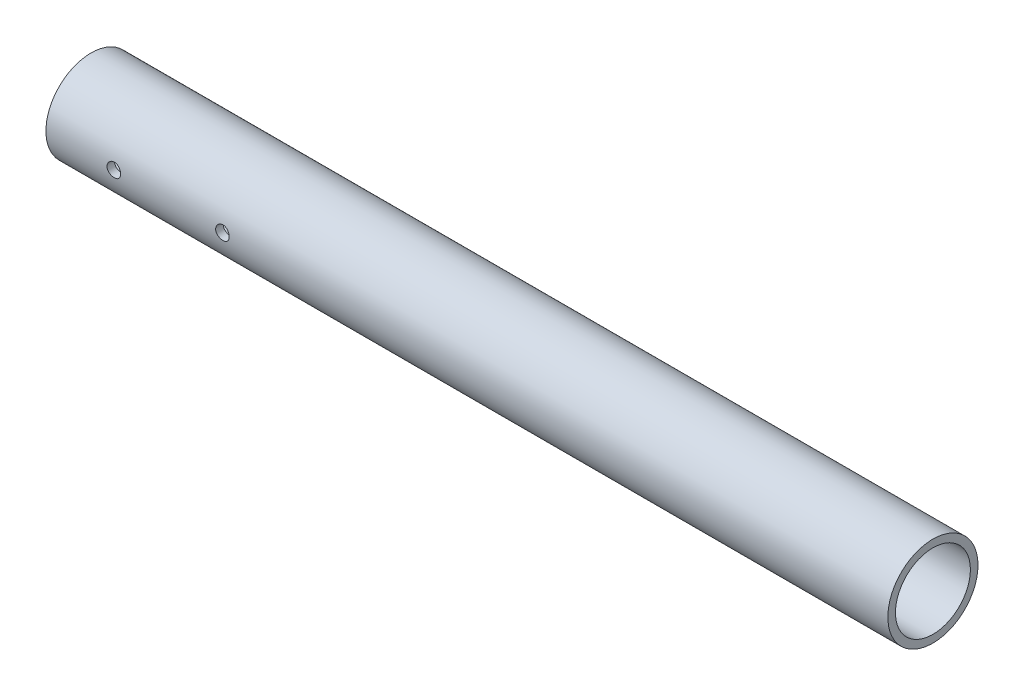
ISO-10303-21;
HEADER;
FILE_DESCRIPTION(('STEP AP214'),'2;1');
FILE_NAME('part.step','',(''),(''),'','','');
FILE_SCHEMA(('AUTOMOTIVE_DESIGN { 1 0 10303 214 1 1 1 1 }'));
ENDSEC;
DATA;
#1=APPLICATION_CONTEXT('core data for automotive mechanical design processes');
#2=APPLICATION_PROTOCOL_DEFINITION('international standard','automotive_design',2000,#1);
#3=PRODUCT_CONTEXT('',#1,'mechanical');
#4=PRODUCT('Part','Part','',(#3));
#5=PRODUCT_RELATED_PRODUCT_CATEGORY('part','',(#4));
#6=PRODUCT_DEFINITION_FORMATION('','',#4);
#7=PRODUCT_DEFINITION_CONTEXT('part definition',#1,'design');
#8=PRODUCT_DEFINITION('design','',#6,#7);
#9=PRODUCT_DEFINITION_SHAPE('','',#8);
#10=(LENGTH_UNIT() NAMED_UNIT(*) SI_UNIT(.MILLI.,.METRE.));
#11=(NAMED_UNIT(*) PLANE_ANGLE_UNIT() SI_UNIT($,.RADIAN.));
#12=(NAMED_UNIT(*) SI_UNIT($,.STERADIAN.) SOLID_ANGLE_UNIT());
#13=UNCERTAINTY_MEASURE_WITH_UNIT(LENGTH_MEASURE(1.E-05),#10,'distance_accuracy_value','');
#14=(GEOMETRIC_REPRESENTATION_CONTEXT(3) GLOBAL_UNCERTAINTY_ASSIGNED_CONTEXT((#13)) GLOBAL_UNIT_ASSIGNED_CONTEXT((#10,
#11,#12)) REPRESENTATION_CONTEXT('',''));
#15=CARTESIAN_POINT('',(0.,0.,0.));
#16=DIRECTION('',(0.,0.,1.));
#17=DIRECTION('',(1.,0.,0.));
#18=AXIS2_PLACEMENT_3D('',#15,#16,#17);
#19=CARTESIAN_POINT('',(-196.85,0.,0.));
#20=DIRECTION('',(1.,0.,0.));
#21=DIRECTION('',(0.,0.,-1.));
#22=AXIS2_PLACEMENT_3D('',#19,#20,#21);
#23=CYLINDRICAL_SURFACE('',#22,21.082);
#24=CARTESIAN_POINT('',(-196.85,0.,0.));
#25=DIRECTION('',(1.,0.,0.));
#26=DIRECTION('',(0.,0.,-1.));
#27=AXIS2_PLACEMENT_3D('',#24,#25,#26);
#28=CIRCLE('',#27,21.082);
#29=CARTESIAN_POINT('',(-196.85,0.,-21.082));
#30=VERTEX_POINT('',#29);
#31=EDGE_CURVE('E10',#30,#30,#28,.T.);
#32=ORIENTED_EDGE('',*,*,#31,.T.);
#33=EDGE_LOOP('',(#32));
#34=FACE_BOUND('',#33,.T.);
#35=CARTESIAN_POINT('',(196.85,0.,0.));
#36=DIRECTION('',(1.,0.,0.));
#37=DIRECTION('',(0.,0.,-1.));
#38=AXIS2_PLACEMENT_3D('',#35,#36,#37);
#39=CIRCLE('',#38,21.082);
#40=CARTESIAN_POINT('',(196.85,0.,-21.082));
#41=VERTEX_POINT('',#40);
#42=EDGE_CURVE('E53',#41,#41,#39,.T.);
#43=ORIENTED_EDGE('',*,*,#42,.F.);
#44=EDGE_LOOP('',(#43));
#45=FACE_BOUND('',#44,.T.);
#46=CARTESIAN_POINT('',(-168.275,0.,21.082));
#47=CARTESIAN_POINT('',(-168.274992696243,0.177265588906064,21.0819971511082));
#48=CARTESIAN_POINT('',(-168.260104327722,0.354633825443566,21.0797407978607));
#49=CARTESIAN_POINT('',(-168.200959639785,0.704412011201187,21.0709569196678));
#50=CARTESIAN_POINT('',(-168.156674780004,0.876816971803984,21.064425243998));
#51=CARTESIAN_POINT('',(-168.040090861165,1.2115560497482,21.0478246855302));
#52=CARTESIAN_POINT('',(-167.967813035828,1.37389769247854,21.0377584843423));
#53=CARTESIAN_POINT('',(-167.797346902468,1.68412370373541,21.0152009969064));
#54=CARTESIAN_POINT('',(-167.69916217104,1.8320100640365,21.0027100454717));
#55=CARTESIAN_POINT('',(-167.478845794194,2.11031643435081,20.9765819826565));
#56=CARTESIAN_POINT('',(-167.3565504399,2.24060616148059,20.9629374218632));
#57=CARTESIAN_POINT('',(-167.091836613573,2.47889671955909,20.9360982303561));
#58=CARTESIAN_POINT('',(-166.949416981135,2.58689626432784,20.9229036256421));
#59=CARTESIAN_POINT('',(-166.647621345587,2.77804840978029,20.8983859912104));
#60=CARTESIAN_POINT('',(-166.488164593206,2.86107486347093,20.8870725883659));
#61=CARTESIAN_POINT('',(-166.157370426842,2.99911783525678,20.8677000439257));
#62=CARTESIAN_POINT('',(-165.986033666236,3.05413589237425,20.8596407235276));
#63=CARTESIAN_POINT('',(-165.637713637157,3.13419550245969,20.8477621012251));
#64=CARTESIAN_POINT('',(-165.460782744137,3.15946016290709,20.8439112577396));
#65=CARTESIAN_POINT('',(-165.105154056933,3.17998699422211,20.8407898425614));
#66=CARTESIAN_POINT('',(-164.926456365603,3.17525090142445,20.8415190057945));
#67=CARTESIAN_POINT('',(-164.573943290049,3.13609297404926,20.8474463775802));
#68=CARTESIAN_POINT('',(-164.40009957517,3.101919701057,20.852607165254));
#69=CARTESIAN_POINT('',(-164.060642024393,3.00524659900985,20.8667578327125));
#70=CARTESIAN_POINT('',(-163.895028423173,2.9427459627244,20.8757478216156));
#71=CARTESIAN_POINT('',(-163.57597641876,2.79093400118089,20.8965852461813));
#72=CARTESIAN_POINT('',(-163.422588837981,2.70151746318002,20.9084438587404));
#73=CARTESIAN_POINT('',(-163.132900855916,2.49848682809598,20.9336742925736));
#74=CARTESIAN_POINT('',(-162.996601585936,2.38487113028626,20.9470462139227));
#75=CARTESIAN_POINT('',(-162.743518756676,2.13530326568608,20.9739618878807));
#76=CARTESIAN_POINT('',(-162.626945855511,1.99913740955179,20.9875060134767));
#77=CARTESIAN_POINT('',(-162.418274544488,1.70906259522473,21.0131148002247));
#78=CARTESIAN_POINT('',(-162.326176243369,1.55515355820367,21.0251794548033));
#79=CARTESIAN_POINT('',(-162.169057340399,1.23377816277263,21.0464826923882));
#80=CARTESIAN_POINT('',(-162.104053073529,1.0663036982249,21.0557195696406));
#81=CARTESIAN_POINT('',(-162.003151041654,0.722645240857121,21.070312259879));
#82=CARTESIAN_POINT('',(-161.967251292923,0.546461842495148,21.0756683373726));
#83=CARTESIAN_POINT('',(-161.925857666781,0.192204765370476,21.0818608911754));
#84=CARTESIAN_POINT('',(-161.920074191204,0.014165649847102,21.0827404122035));
#85=CARTESIAN_POINT('',(-161.938308481612,-0.340339952440584,21.0799979514801));
#86=CARTESIAN_POINT('',(-161.962325317379,-0.516806488119846,21.0763761102388));
#87=CARTESIAN_POINT('',(-162.039237666121,-0.862279899383923,21.0650645063623));
#88=CARTESIAN_POINT('',(-162.091992010307,-1.03131891039135,21.0573946347692));
#89=CARTESIAN_POINT('',(-162.224732948251,-1.35815274399451,21.0388441665934));
#90=CARTESIAN_POINT('',(-162.304720829788,-1.51594703443955,21.0279634181826));
#91=CARTESIAN_POINT('',(-162.490337139215,-1.81708511576191,21.0040933283749));
#92=CARTESIAN_POINT('',(-162.596149173084,-1.9603145348408,20.9910891189132));
#93=CARTESIAN_POINT('',(-162.830154648818,-2.22708618632573,20.9644655933992));
#94=CARTESIAN_POINT('',(-162.958349402479,-2.35062726403488,20.9508462413297));
#95=CARTESIAN_POINT('',(-163.234770906888,-2.57556977848286,20.9243908347895));
#96=CARTESIAN_POINT('',(-163.383156506261,-2.67677703259561,20.9115622997957));
#97=CARTESIAN_POINT('',(-163.694991994603,-2.8528290309045,20.888274456038));
#98=CARTESIAN_POINT('',(-163.858441473836,-2.92767449187153,20.8778150828597));
#99=CARTESIAN_POINT('',(-164.195187201683,-3.04857772519442,20.8605043047131));
#100=CARTESIAN_POINT('',(-164.368446144862,-3.09473749350594,20.8536401303661));
#101=CARTESIAN_POINT('',(-164.720368391081,-3.15728352894343,20.8442630448294));
#102=CARTESIAN_POINT('',(-164.899031316753,-3.17367187018762,20.8417498305174));
#103=CARTESIAN_POINT('',(-165.25475433616,-3.17616021106899,20.8413705974415));
#104=CARTESIAN_POINT('',(-165.431812319645,-3.16256554437416,20.8434577306442));
#105=CARTESIAN_POINT('',(-165.781093207795,-3.10612829026899,20.8519421795031));
#106=CARTESIAN_POINT('',(-165.95331612046,-3.0632857512491,20.8583394880282));
#107=CARTESIAN_POINT('',(-166.287952316415,-2.94967717748468,20.874707044174));
#108=CARTESIAN_POINT('',(-166.450373046203,-2.87893265513936,20.8846745386426));
#109=CARTESIAN_POINT('',(-166.761089428502,-2.71155871536681,20.9070627102117));
#110=CARTESIAN_POINT('',(-166.909384594736,-2.61492840724793,20.9194834717215));
#111=CARTESIAN_POINT('',(-167.189191280687,-2.39741725845486,20.9455292166376));
#112=CARTESIAN_POINT('',(-167.320526091709,-2.27631033164998,20.9591647100844));
#113=CARTESIAN_POINT('',(-167.561117181648,-2.01376149306829,20.9860159394496));
#114=CARTESIAN_POINT('',(-167.670368323069,-1.87231486257536,20.9992315770924));
#115=CARTESIAN_POINT('',(-167.864233030242,-1.57217776718591,21.0238378848768));
#116=CARTESIAN_POINT('',(-167.948706474533,-1.41339594518085,21.0352180180234));
#117=CARTESIAN_POINT('',(-168.089658721969,-1.08380087043068,21.0547677779054));
#118=CARTESIAN_POINT('',(-168.146166480664,-0.913000272113377,21.0629407235248));
#119=CARTESIAN_POINT('',(-168.216783136409,-0.617864332480806,21.0732924950954));
#120=CARTESIAN_POINT('',(-168.238581040015,-0.495349503289414,21.0765410154751));
#121=CARTESIAN_POINT('',(-168.267691941695,-0.248573261637352,21.0808957533839));
#122=CARTESIAN_POINT('',(-168.27500512194,-0.124311871162611,21.0820019978558));
#123=CARTESIAN_POINT('',(-168.275,0.,21.082));
#124=B_SPLINE_CURVE_WITH_KNOTS('',3,(#46,#47,#48,#49,#50,#51,#52,#53,#54,#55,#56,#57,#58,#59,
#60,#61,#62,#63,#64,#65,#66,#67,#68,#69,#70,#71,#72,#73,#74,#75,#76,#77,#78,#79,#80,#81,#82,#83,
#84,#85,#86,#87,#88,#89,#90,#91,#92,#93,#94,#95,#96,#97,#98,#99,#100,#101,#102,#103,#104,#105,
#106,#107,#108,#109,#110,#111,#112,#113,#114,#115,#116,#117,#118,#119,#120,#121,#122,#123),
.UNSPECIFIED.,.T.,.F.,(4,2,2,2,2,2,2,2,2,2,2,2,2,2,2,2,2,2,2,2,2,2,2,2,2,2,2,2,2,2,2,2,2,2,2,2,
2,2,4),(0.,0.53134251242904,1.06320164882559,1.59465813765312,2.12604129424768,2.66116512439553,
3.19631982343619,3.73413403476708,4.27191869076778,4.80564452954643,5.33933947849274,
5.86857170164555,6.39781900700993,6.92916258470443,7.46054132064736,7.99727852314497,
8.53401811031675,9.07108083107701,9.60810694326931,10.1399593459211,10.6717951472021,
11.2010416383702,11.730313159249,12.2634633412738,12.7966447804,13.3342937698578,
13.8719281396386,14.4076397711918,14.9433140793118,15.4735585288678,16.0038021011393,
16.5336376528597,17.0634914377811,17.5984835709691,18.1336000206728,18.6716867332597,
19.2092151415009,19.5818368843675,19.9544539408189),.UNSPECIFIED.);
#125=CARTESIAN_POINT('',(-168.275,0.,21.082));
#126=VERTEX_POINT('',#125);
#127=EDGE_CURVE('E62',#126,#126,#124,.T.);
#128=ORIENTED_EDGE('',*,*,#127,.T.);
#129=EDGE_LOOP('',(#128));
#130=FACE_BOUND('',#129,.T.);
#131=CARTESIAN_POINT('',(-117.475,0.,21.082));
#132=CARTESIAN_POINT('',(-117.474992696243,0.177265588906064,21.0819971511082));
#133=CARTESIAN_POINT('',(-117.460104327722,0.354633825443565,21.0797407978607));
#134=CARTESIAN_POINT('',(-117.400959639785,0.704412011201185,21.0709569196678));
#135=CARTESIAN_POINT('',(-117.356674780004,0.876816971803983,21.064425243998));
#136=CARTESIAN_POINT('',(-117.240090861165,1.21155604974819,21.0478246855302));
#137=CARTESIAN_POINT('',(-117.167813035828,1.37389769247853,21.0377584843423));
#138=CARTESIAN_POINT('',(-116.997346902468,1.68412370373539,21.0152009969064));
#139=CARTESIAN_POINT('',(-116.89916217104,1.83201006403648,21.0027100454717));
#140=CARTESIAN_POINT('',(-116.678845794194,2.1103164343508,20.9765819826565));
#141=CARTESIAN_POINT('',(-116.5565504399,2.24060616148058,20.9629374218632));
#142=CARTESIAN_POINT('',(-116.291836613573,2.47889671955908,20.9360982303561));
#143=CARTESIAN_POINT('',(-116.149416981135,2.58689626432783,20.9229036256421));
#144=CARTESIAN_POINT('',(-115.847621345587,2.77804840978028,20.8983859912104));
#145=CARTESIAN_POINT('',(-115.688164593206,2.86107486347092,20.8870725883659));
#146=CARTESIAN_POINT('',(-115.357370426842,2.99911783525677,20.8677000439257));
#147=CARTESIAN_POINT('',(-115.186033666236,3.05413589237424,20.8596407235276));
#148=CARTESIAN_POINT('',(-114.837713637157,3.13419550245969,20.8477621012251));
#149=CARTESIAN_POINT('',(-114.660782744137,3.15946016290709,20.8439112577396));
#150=CARTESIAN_POINT('',(-114.305154056933,3.17998699422211,20.8407898425614));
#151=CARTESIAN_POINT('',(-114.126456365603,3.17525090142445,20.8415190057945));
#152=CARTESIAN_POINT('',(-113.773943290049,3.13609297404926,20.8474463775802));
#153=CARTESIAN_POINT('',(-113.60009957517,3.101919701057,20.852607165254));
#154=CARTESIAN_POINT('',(-113.260642024393,3.00524659900985,20.8667578327125));
#155=CARTESIAN_POINT('',(-113.095028423174,2.94274596272441,20.8757478216156));
#156=CARTESIAN_POINT('',(-112.77597641876,2.7909340011809,20.8965852461813));
#157=CARTESIAN_POINT('',(-112.622588837981,2.70151746318003,20.9084438587404));
#158=CARTESIAN_POINT('',(-112.332900855916,2.498486828096,20.9336742925736));
#159=CARTESIAN_POINT('',(-112.196601585936,2.38487113028627,20.9470462139227));
#160=CARTESIAN_POINT('',(-111.943518756676,2.1353032656861,20.9739618878806));
#161=CARTESIAN_POINT('',(-111.826945855511,1.99913740955181,20.9875060134767));
#162=CARTESIAN_POINT('',(-111.618274544488,1.70906259522474,21.0131148002247));
#163=CARTESIAN_POINT('',(-111.526176243369,1.55515355820369,21.0251794548033));
#164=CARTESIAN_POINT('',(-111.369057340399,1.23377816277264,21.0464826923882));
#165=CARTESIAN_POINT('',(-111.304053073529,1.06630369822491,21.0557195696406));
#166=CARTESIAN_POINT('',(-111.203151041654,0.722645240857131,21.070312259879));
#167=CARTESIAN_POINT('',(-111.167251292923,0.546461842495156,21.0756683373726));
#168=CARTESIAN_POINT('',(-111.125857666781,0.192204765370483,21.0818608911754));
#169=CARTESIAN_POINT('',(-111.120074191204,0.0141656498471105,21.0827404122035));
#170=CARTESIAN_POINT('',(-111.138308481612,-0.340339952440575,21.0799979514801));
#171=CARTESIAN_POINT('',(-111.162325317379,-0.516806488119837,21.0763761102388));
#172=CARTESIAN_POINT('',(-111.239237666121,-0.86227989938391,21.0650645063623));
#173=CARTESIAN_POINT('',(-111.291992010307,-1.03131891039133,21.0573946347692));
#174=CARTESIAN_POINT('',(-111.424732948251,-1.35815274399449,21.0388441665934));
#175=CARTESIAN_POINT('',(-111.504720829788,-1.51594703443953,21.0279634181826));
#176=CARTESIAN_POINT('',(-111.690337139215,-1.81708511576191,21.0040933283749));
#177=CARTESIAN_POINT('',(-111.796149173084,-1.9603145348408,20.9910891189132));
#178=CARTESIAN_POINT('',(-112.030154648818,-2.22708618632573,20.9644655933992));
#179=CARTESIAN_POINT('',(-112.158349402479,-2.35062726403487,20.9508462413297));
#180=CARTESIAN_POINT('',(-112.434770906888,-2.57556977848285,20.9243908347895));
#181=CARTESIAN_POINT('',(-112.583156506261,-2.67677703259561,20.9115622997957));
#182=CARTESIAN_POINT('',(-112.894991994603,-2.85282903090451,20.888274456038));
#183=CARTESIAN_POINT('',(-113.058441473836,-2.92767449187153,20.8778150828597));
#184=CARTESIAN_POINT('',(-113.395187201683,-3.04857772519442,20.8605043047131));
#185=CARTESIAN_POINT('',(-113.568446144862,-3.09473749350594,20.8536401303661));
#186=CARTESIAN_POINT('',(-113.920368391081,-3.15728352894343,20.8442630448294));
#187=CARTESIAN_POINT('',(-114.099031316753,-3.17367187018762,20.8417498305174));
#188=CARTESIAN_POINT('',(-114.45475433616,-3.17616021106898,20.8413705974415));
#189=CARTESIAN_POINT('',(-114.631812319645,-3.16256554437416,20.8434577306442));
#190=CARTESIAN_POINT('',(-114.981093207795,-3.10612829026899,20.8519421795031));
#191=CARTESIAN_POINT('',(-115.15331612046,-3.0632857512491,20.8583394880282));
#192=CARTESIAN_POINT('',(-115.487952316415,-2.94967717748468,20.874707044174));
#193=CARTESIAN_POINT('',(-115.650373046203,-2.87893265513936,20.8846745386426));
#194=CARTESIAN_POINT('',(-115.961089428502,-2.71155871536682,20.9070627102117));
#195=CARTESIAN_POINT('',(-116.109384594736,-2.61492840724794,20.9194834717215));
#196=CARTESIAN_POINT('',(-116.389191280687,-2.39741725845485,20.9455292166376));
#197=CARTESIAN_POINT('',(-116.520526091709,-2.27631033164997,20.9591647100844));
#198=CARTESIAN_POINT('',(-116.761117181648,-2.01376149306828,20.9860159394496));
#199=CARTESIAN_POINT('',(-116.870368323069,-1.87231486257537,20.9992315770924));
#200=CARTESIAN_POINT('',(-117.064233030242,-1.57217776718592,21.0238378848768));
#201=CARTESIAN_POINT('',(-117.148706474533,-1.41339594518085,21.0352180180234));
#202=CARTESIAN_POINT('',(-117.289658721969,-1.08380087043068,21.0547677779054));
#203=CARTESIAN_POINT('',(-117.346166480664,-0.913000272113387,21.0629407235248));
#204=CARTESIAN_POINT('',(-117.416783136409,-0.617864332480819,21.0732924950954));
#205=CARTESIAN_POINT('',(-117.438581040015,-0.495349503289426,21.0765410154751));
#206=CARTESIAN_POINT('',(-117.467691941695,-0.248573261637358,21.0808957533839));
#207=CARTESIAN_POINT('',(-117.47500512194,-0.124311871162614,21.0820019978558));
#208=CARTESIAN_POINT('',(-117.475,0.,21.082));
#209=B_SPLINE_CURVE_WITH_KNOTS('',3,(#131,#132,#133,#134,#135,#136,#137,#138,#139,#140,#141,
#142,#143,#144,#145,#146,#147,#148,#149,#150,#151,#152,#153,#154,#155,#156,#157,#158,#159,#160,
#161,#162,#163,#164,#165,#166,#167,#168,#169,#170,#171,#172,#173,#174,#175,#176,#177,#178,#179,
#180,#181,#182,#183,#184,#185,#186,#187,#188,#189,#190,#191,#192,#193,#194,#195,#196,#197,#198,
#199,#200,#201,#202,#203,#204,#205,#206,#207,#208),.UNSPECIFIED.,.T.,.F.,(4,2,2,2,2,2,2,2,2,2,2,
2,2,2,2,2,2,2,2,2,2,2,2,2,2,2,2,2,2,2,2,2,2,2,2,2,2,2,4),(0.,0.531342512429038,1.06320164882558,
1.5946581376531,2.12604129424767,2.66116512439551,3.19631982343617,3.73413403476706,
4.27191869076775,4.80564452954642,5.33933947849273,5.86857170164552,6.39781900700991,
6.92916258470442,7.46054132064733,7.99727852314494,8.53401811031673,9.07108083107699,
9.6081069432693,10.1399593459211,10.6717951472021,11.2010416383702,11.730313159249,
12.2634633412738,12.7966447804,13.3342937698578,13.8719281396386,14.4076397711918,
14.9433140793118,15.4735585288678,16.0038021011393,16.5336376528597,17.0634914377811,
17.5984835709691,18.1336000206727,18.6716867332597,19.2092151415009,19.5818368843675,
19.9544539408189),.UNSPECIFIED.);
#210=CARTESIAN_POINT('',(-117.475,0.,21.082));
#211=VERTEX_POINT('',#210);
#212=EDGE_CURVE('E80',#211,#211,#209,.T.);
#213=ORIENTED_EDGE('',*,*,#212,.T.);
#214=EDGE_LOOP('',(#213));
#215=FACE_BOUND('',#214,.T.);
#216=ADVANCED_FACE('F35',(#34,#45,#130,#215),#23,.T.);
#217=CARTESIAN_POINT('',(-196.85,0.,0.));
#218=DIRECTION('',(1.,0.,0.));
#219=DIRECTION('',(0.,0.,-1.));
#220=AXIS2_PLACEMENT_3D('',#217,#218,#219);
#221=CYLINDRICAL_SURFACE('',#220,17.526);
#222=CARTESIAN_POINT('',(-196.85,0.,0.));
#223=DIRECTION('',(1.,0.,0.));
#224=DIRECTION('',(0.,0.,-1.));
#225=AXIS2_PLACEMENT_3D('',#222,#223,#224);
#226=CIRCLE('',#225,17.526);
#227=CARTESIAN_POINT('',(-196.85,0.,-17.526));
#228=VERTEX_POINT('',#227);
#229=EDGE_CURVE('E48',#228,#228,#226,.T.);
#230=ORIENTED_EDGE('',*,*,#229,.F.);
#231=EDGE_LOOP('',(#230));
#232=FACE_BOUND('',#231,.T.);
#233=CARTESIAN_POINT('',(196.85,0.,0.));
#234=DIRECTION('',(1.,0.,0.));
#235=DIRECTION('',(0.,0.,-1.));
#236=AXIS2_PLACEMENT_3D('',#233,#234,#235);
#237=CIRCLE('',#236,17.526);
#238=CARTESIAN_POINT('',(196.85,0.,-17.526));
#239=VERTEX_POINT('',#238);
#240=EDGE_CURVE('E86',#239,#239,#237,.T.);
#241=ORIENTED_EDGE('',*,*,#240,.T.);
#242=EDGE_LOOP('',(#241));
#243=FACE_BOUND('',#242,.T.);
#244=CARTESIAN_POINT('',(-168.275,0.,17.526));
#245=CARTESIAN_POINT('',(-168.274993132514,0.176790823508008,17.5259968412274));
#246=CARTESIAN_POINT('',(-168.26018396573,0.353672270747985,17.5232972774411));
#247=CARTESIAN_POINT('',(-168.201372438004,0.702458155041367,17.5127883009458));
#248=CARTESIAN_POINT('',(-168.157344740396,0.874358137310074,17.5049744534986));
#249=CARTESIAN_POINT('',(-168.041482418544,1.20808580036968,17.485111731742));
#250=CARTESIAN_POINT('',(-167.96967216344,1.3699221643449,17.4730665697294));
#251=CARTESIAN_POINT('',(-167.800350679922,1.67923272236703,17.4460593997375));
#252=CARTESIAN_POINT('',(-167.702841801324,1.82670822784651,17.4310976584752));
#253=CARTESIAN_POINT('',(-167.483729501993,2.10478127681953,17.3997234174553));
#254=CARTESIAN_POINT('',(-167.361893953305,2.23519445696565,17.3832978577657));
#255=CARTESIAN_POINT('',(-167.098086238519,2.47384671567765,17.3509451203049));
#256=CARTESIAN_POINT('',(-166.956112684689,2.58208426483874,17.3350179769725));
#257=CARTESIAN_POINT('',(-166.65476755925,2.77407084888638,17.3053386524232));
#258=CARTESIAN_POINT('',(-166.49527574471,2.8576339824516,17.2916033234658));
#259=CARTESIAN_POINT('',(-166.164227502684,2.9967100266702,17.2680459841376));
#260=CARTESIAN_POINT('',(-165.992672044777,3.05222518866685,17.2582236596927));
#261=CARTESIAN_POINT('',(-165.644333420596,3.13304110203761,17.2437354838221));
#262=CARTESIAN_POINT('',(-165.467626937035,3.15866238598857,17.2390149702052));
#263=CARTESIAN_POINT('',(-165.112365006253,3.17995782064228,17.235099927382));
#264=CARTESIAN_POINT('',(-164.933809714956,3.1756344765814,17.2359049358977));
#265=CARTESIAN_POINT('',(-164.582230051004,3.13742365897766,17.2429001682717));
#266=CARTESIAN_POINT('',(-164.409164708668,3.10389926153133,17.2490242538492));
#267=CARTESIAN_POINT('',(-164.071156214092,3.00880912932248,17.2658638407267));
#268=CARTESIAN_POINT('',(-163.906213386391,2.94724227511611,17.2765795253205));
#269=CARTESIAN_POINT('',(-163.588061936362,2.79745571266685,17.3014647929721));
#270=CARTESIAN_POINT('',(-163.434924507933,2.70908808725447,17.3156534578234));
#271=CARTESIAN_POINT('',(-163.145514150003,2.50831315208049,17.3458731721502));
#272=CARTESIAN_POINT('',(-163.009242823655,2.39590355985283,17.3619043964854));
#273=CARTESIAN_POINT('',(-162.755333896299,2.14827149301382,17.3942918762038));
#274=CARTESIAN_POINT('',(-162.637999429291,2.01273815664841,17.4106494468318));
#275=CARTESIAN_POINT('',(-162.427688621113,1.72374960651158,17.4416297211863));
#276=CARTESIAN_POINT('',(-162.334712494357,1.57029423499867,17.4562524096409));
#277=CARTESIAN_POINT('',(-162.175718396598,1.24951132270804,17.4821419521182));
#278=CARTESIAN_POINT('',(-162.109730448668,1.08216858038396,17.4934050650234));
#279=CARTESIAN_POINT('',(-162.006884348364,0.738524824278301,17.5112771866033));
#280=CARTESIAN_POINT('',(-161.970023310367,0.562224699752729,17.5178866563105));
#281=CARTESIAN_POINT('',(-161.926895827197,0.208280155645559,17.5256438790602));
#282=CARTESIAN_POINT('',(-161.920213792981,0.0306879466818512,17.5268658171028));
#283=CARTESIAN_POINT('',(-161.936521371192,-0.323076767936706,17.5239146703191));
#284=CARTESIAN_POINT('',(-161.959509626478,-0.499249338156011,17.5197418322538));
#285=CARTESIAN_POINT('',(-162.034159642385,-0.843866600411561,17.5065161011469));
#286=CARTESIAN_POINT('',(-162.085612547972,-1.01235801735562,17.4974987676082));
#287=CARTESIAN_POINT('',(-162.215506359517,-1.3383231301214,17.4755909179164));
#288=CARTESIAN_POINT('',(-162.293949001188,-1.49579611656222,17.4627001526692));
#289=CARTESIAN_POINT('',(-162.476525502701,-1.79703794282551,17.4342904171948));
#290=CARTESIAN_POINT('',(-162.580915097512,-1.94064931955918,17.4187457992515));
#291=CARTESIAN_POINT('',(-162.812074418528,-2.20846506883692,17.3868220571775));
#292=CARTESIAN_POINT('',(-162.938846086358,-2.33266775593063,17.3704428607355));
#293=CARTESIAN_POINT('',(-163.213047053409,-2.55970748627499,17.3384518393717));
#294=CARTESIAN_POINT('',(-163.360712095506,-2.66226178053652,17.3228519867864));
#295=CARTESIAN_POINT('',(-163.671417833441,-2.84110984177048,17.2944212278246));
#296=CARTESIAN_POINT('',(-163.834457982026,-2.91740454296297,17.2815902229488));
#297=CARTESIAN_POINT('',(-164.170545034343,-3.04115979533501,17.2602426012819));
#298=CARTESIAN_POINT('',(-164.34354160251,-3.08875345587471,17.2517060985603));
#299=CARTESIAN_POINT('',(-164.695243732187,-3.1541689769781,17.2398671271274));
#300=CARTESIAN_POINT('',(-164.873948695075,-3.17199394891528,17.2365641114227));
#301=CARTESIAN_POINT('',(-165.229165541857,-3.17726742876193,17.2355925385196));
#302=CARTESIAN_POINT('',(-165.405670738435,-3.16516161695717,17.2378413124165));
#303=CARTESIAN_POINT('',(-165.754086632076,-3.11188910689162,17.2475373034534));
#304=CARTESIAN_POINT('',(-165.925997352356,-3.07072255551699,17.2549844943182));
#305=CARTESIAN_POINT('',(-166.260125897203,-2.96067981082376,17.2742044563146));
#306=CARTESIAN_POINT('',(-166.422359022944,-2.8918487670874,17.2859701767276));
#307=CARTESIAN_POINT('',(-166.733046204286,-2.72847862049298,17.3125070165183));
#308=CARTESIAN_POINT('',(-166.88149937582,-2.63393786972799,17.3272783285293));
#309=CARTESIAN_POINT('',(-167.162651300551,-2.42026944589852,17.3584203635157));
#310=CARTESIAN_POINT('',(-167.295100559389,-2.30081626698694,17.37481057328));
#311=CARTESIAN_POINT('',(-167.53822420719,-2.04139533634302,17.4071948659678));
#312=CARTESIAN_POINT('',(-167.648893583025,-1.90142287454243,17.4231888569539));
#313=CARTESIAN_POINT('',(-167.846171023297,-1.60354404533996,17.4531342301883));
#314=CARTESIAN_POINT('',(-167.932571193469,-1.44549813095463,17.4670675069251));
#315=CARTESIAN_POINT('',(-168.077456942508,-1.11693687333545,17.4911451342375));
#316=CARTESIAN_POINT('',(-168.135969245347,-0.946433648982024,17.5012931100993));
#317=CARTESIAN_POINT('',(-168.211276479759,-0.646146664812287,17.5145413811557));
#318=CARTESIAN_POINT('',(-168.235132786512,-0.518138865968793,17.5188145120769));
#319=CARTESIAN_POINT('',(-168.266996893811,-0.260103700609919,17.5245449517082));
#320=CARTESIAN_POINT('',(-168.275005052851,-0.130076379844322,17.5260023241122));
#321=CARTESIAN_POINT('',(-168.275,0.,17.526));
#322=B_SPLINE_CURVE_WITH_KNOTS('',3,(#244,#245,#246,#247,#248,#249,#250,#251,#252,#253,#254,
#255,#256,#257,#258,#259,#260,#261,#262,#263,#264,#265,#266,#267,#268,#269,#270,#271,#272,#273,
#274,#275,#276,#277,#278,#279,#280,#281,#282,#283,#284,#285,#286,#287,#288,#289,#290,#291,#292,
#293,#294,#295,#296,#297,#298,#299,#300,#301,#302,#303,#304,#305,#306,#307,#308,#309,#310,#311,
#312,#313,#314,#315,#316,#317,#318,#319,#320,#321),.UNSPECIFIED.,.T.,.F.,(4,2,2,2,2,2,2,2,2,2,2,
2,2,2,2,2,2,2,2,2,2,2,2,2,2,2,2,2,2,2,2,2,2,2,2,2,2,2,4),(0.,0.52989684739867,1.06025379298762,
1.59014659312776,2.11999095802633,2.65515610450925,3.19035814774706,3.72949522868479,
4.26858902750703,4.80184775131234,5.33506186200683,5.86173930617049,6.3884377769336,
6.91809776769754,7.44780806499452,7.985299753981,8.52279617407827,9.06088891772035,
9.59892834547639,10.1295354893394,10.6601183636946,11.1868588327276,11.713633182854,
12.2458209999473,12.778055006572,13.3168607871052,13.8556473969223,14.3919156166158,
14.9281277829441,15.4564037756751,15.9846770982785,16.5120917356115,17.0395401864443,
17.5743685624972,18.1093198977252,18.648722923454,19.1876080135939,19.5774960261897,
19.9673752191978),.UNSPECIFIED.);
#323=CARTESIAN_POINT('',(-168.275,0.,17.526));
#324=VERTEX_POINT('',#323);
#325=EDGE_CURVE('E56',#324,#324,#322,.T.);
#326=ORIENTED_EDGE('',*,*,#325,.F.);
#327=EDGE_LOOP('',(#326));
#328=FACE_BOUND('',#327,.T.);
#329=CARTESIAN_POINT('',(-117.475,0.,17.526));
#330=CARTESIAN_POINT('',(-117.474993132514,0.176790823508009,17.5259968412274));
#331=CARTESIAN_POINT('',(-117.46018396573,0.353672270747986,17.5232972774411));
#332=CARTESIAN_POINT('',(-117.401372438004,0.702458155041366,17.5127883009458));
#333=CARTESIAN_POINT('',(-117.357344740396,0.874358137310071,17.5049744534986));
#334=CARTESIAN_POINT('',(-117.241482418544,1.20808580036967,17.485111731742));
#335=CARTESIAN_POINT('',(-117.16967216344,1.36992216434489,17.4730665697294));
#336=CARTESIAN_POINT('',(-117.000350679922,1.67923272236702,17.4460593997375));
#337=CARTESIAN_POINT('',(-116.902841801324,1.82670822784651,17.4310976584752));
#338=CARTESIAN_POINT('',(-116.683729501993,2.10478127681952,17.3997234174553));
#339=CARTESIAN_POINT('',(-116.561893953305,2.23519445696564,17.3832978577657));
#340=CARTESIAN_POINT('',(-116.298086238519,2.47384671567764,17.3509451203049));
#341=CARTESIAN_POINT('',(-116.156112684689,2.58208426483874,17.3350179769725));
#342=CARTESIAN_POINT('',(-115.85476755925,2.77407084888638,17.3053386524232));
#343=CARTESIAN_POINT('',(-115.69527574471,2.85763398245159,17.2916033234658));
#344=CARTESIAN_POINT('',(-115.364227502684,2.9967100266702,17.2680459841376));
#345=CARTESIAN_POINT('',(-115.192672044777,3.05222518866685,17.2582236596927));
#346=CARTESIAN_POINT('',(-114.844333420596,3.13304110203761,17.2437354838221));
#347=CARTESIAN_POINT('',(-114.667626937035,3.15866238598856,17.2390149702052));
#348=CARTESIAN_POINT('',(-114.312365006253,3.17995782064228,17.235099927382));
#349=CARTESIAN_POINT('',(-114.133809714956,3.1756344765814,17.2359049358977));
#350=CARTESIAN_POINT('',(-113.782230051004,3.13742365897766,17.2429001682717));
#351=CARTESIAN_POINT('',(-113.609164708668,3.10389926153133,17.2490242538492));
#352=CARTESIAN_POINT('',(-113.271156214092,3.00880912932249,17.2658638407267));
#353=CARTESIAN_POINT('',(-113.106213386391,2.94724227511612,17.2765795253205));
#354=CARTESIAN_POINT('',(-112.788061936362,2.79745571266688,17.3014647929721));
#355=CARTESIAN_POINT('',(-112.634924507933,2.7090880872545,17.3156534578234));
#356=CARTESIAN_POINT('',(-112.345514150003,2.50831315208051,17.3458731721502));
#357=CARTESIAN_POINT('',(-112.209242823655,2.39590355985285,17.3619043964854));
#358=CARTESIAN_POINT('',(-111.955333896299,2.14827149301383,17.3942918762038));
#359=CARTESIAN_POINT('',(-111.837999429291,2.01273815664842,17.4106494468318));
#360=CARTESIAN_POINT('',(-111.627688621113,1.72374960651159,17.4416297211863));
#361=CARTESIAN_POINT('',(-111.534712494357,1.57029423499867,17.4562524096409));
#362=CARTESIAN_POINT('',(-111.375718396598,1.24951132270804,17.4821419521182));
#363=CARTESIAN_POINT('',(-111.309730448668,1.08216858038397,17.4934050650234));
#364=CARTESIAN_POINT('',(-111.206884348364,0.73852482427832,17.5112771866033));
#365=CARTESIAN_POINT('',(-111.170023310367,0.562224699752747,17.5178866563105));
#366=CARTESIAN_POINT('',(-111.126895827197,0.208280155645574,17.5256438790602));
#367=CARTESIAN_POINT('',(-111.120213792981,0.0306879466818639,17.5268658171028));
#368=CARTESIAN_POINT('',(-111.136521371192,-0.323076767936695,17.5239146703191));
#369=CARTESIAN_POINT('',(-111.159509626478,-0.499249338156001,17.5197418322538));
#370=CARTESIAN_POINT('',(-111.234159642385,-0.843866600411554,17.5065161011469));
#371=CARTESIAN_POINT('',(-111.285612547972,-1.01235801735561,17.4974987676082));
#372=CARTESIAN_POINT('',(-111.415506359517,-1.33832313012139,17.4755909179164));
#373=CARTESIAN_POINT('',(-111.493949001188,-1.49579611656221,17.4627001526692));
#374=CARTESIAN_POINT('',(-111.676525502701,-1.7970379428255,17.4342904171948));
#375=CARTESIAN_POINT('',(-111.780915097512,-1.94064931955918,17.4187457992515));
#376=CARTESIAN_POINT('',(-112.012074418528,-2.20846506883692,17.3868220571775));
#377=CARTESIAN_POINT('',(-112.138846086358,-2.33266775593063,17.3704428607355));
#378=CARTESIAN_POINT('',(-112.413047053409,-2.55970748627499,17.3384518393717));
#379=CARTESIAN_POINT('',(-112.560712095506,-2.66226178053652,17.3228519867864));
#380=CARTESIAN_POINT('',(-112.871417833441,-2.84110984177048,17.2944212278246));
#381=CARTESIAN_POINT('',(-113.034457982026,-2.91740454296296,17.2815902229488));
#382=CARTESIAN_POINT('',(-113.370545034343,-3.04115979533501,17.2602426012819));
#383=CARTESIAN_POINT('',(-113.54354160251,-3.08875345587471,17.2517060985603));
#384=CARTESIAN_POINT('',(-113.895243732187,-3.15416897697809,17.2398671271274));
#385=CARTESIAN_POINT('',(-114.073948695075,-3.17199394891527,17.2365641114227));
#386=CARTESIAN_POINT('',(-114.429165541857,-3.17726742876193,17.2355925385196));
#387=CARTESIAN_POINT('',(-114.605670738435,-3.16516161695717,17.2378413124165));
#388=CARTESIAN_POINT('',(-114.954086632076,-3.11188910689162,17.2475373034534));
#389=CARTESIAN_POINT('',(-115.125997352356,-3.07072255551699,17.2549844943182));
#390=CARTESIAN_POINT('',(-115.460125897203,-2.96067981082377,17.2742044563146));
#391=CARTESIAN_POINT('',(-115.622359022944,-2.89184876708741,17.2859701767276));
#392=CARTESIAN_POINT('',(-115.933046204286,-2.72847862049299,17.3125070165183));
#393=CARTESIAN_POINT('',(-116.08149937582,-2.633937869728,17.3272783285292));
#394=CARTESIAN_POINT('',(-116.362651300551,-2.42026944589855,17.3584203635157));
#395=CARTESIAN_POINT('',(-116.495100559389,-2.30081626698697,17.37481057328));
#396=CARTESIAN_POINT('',(-116.73822420719,-2.04139533634304,17.4071948659678));
#397=CARTESIAN_POINT('',(-116.848893583025,-1.90142287454245,17.4231888569539));
#398=CARTESIAN_POINT('',(-117.046171023297,-1.60354404533997,17.4531342301883));
#399=CARTESIAN_POINT('',(-117.132571193469,-1.44549813095465,17.4670675069251));
#400=CARTESIAN_POINT('',(-117.277456942508,-1.11693687333548,17.4911451342375));
#401=CARTESIAN_POINT('',(-117.335969245347,-0.946433648982046,17.5012931100993));
#402=CARTESIAN_POINT('',(-117.411276479759,-0.646146664812306,17.5145413811557));
#403=CARTESIAN_POINT('',(-117.435132786512,-0.518138865968811,17.5188145120769));
#404=CARTESIAN_POINT('',(-117.466996893811,-0.26010370060993,17.5245449517082));
#405=CARTESIAN_POINT('',(-117.475005052851,-0.130076379844328,17.5260023241122));
#406=CARTESIAN_POINT('',(-117.475,0.,17.526));
#407=B_SPLINE_CURVE_WITH_KNOTS('',3,(#329,#330,#331,#332,#333,#334,#335,#336,#337,#338,#339,
#340,#341,#342,#343,#344,#345,#346,#347,#348,#349,#350,#351,#352,#353,#354,#355,#356,#357,#358,
#359,#360,#361,#362,#363,#364,#365,#366,#367,#368,#369,#370,#371,#372,#373,#374,#375,#376,#377,
#378,#379,#380,#381,#382,#383,#384,#385,#386,#387,#388,#389,#390,#391,#392,#393,#394,#395,#396,
#397,#398,#399,#400,#401,#402,#403,#404,#405,#406),.UNSPECIFIED.,.T.,.F.,(4,2,2,2,2,2,2,2,2,2,2,
2,2,2,2,2,2,2,2,2,2,2,2,2,2,2,2,2,2,2,2,2,2,2,2,2,2,2,4),(0.,0.529896847398668,1.06025379298761,
1.59014659312776,2.11999095802632,2.65515610450925,3.19035814774705,3.72949522868479,
4.26858902750701,4.80184775131233,5.33506186200683,5.86173930617045,6.38843777693352,
6.91809776769748,7.4478080649945,7.98529975398098,8.52279617407827,9.06088891772032,
9.59892834547637,10.1295354893394,10.6601183636945,11.1868588327276,11.713633182854,
12.2458209999474,12.778055006572,13.3168607871052,13.8556473969222,14.3919156166157,
14.9281277829441,15.4564037756751,15.9846770982784,16.5120917356115,17.0395401864443,
17.5743685624972,18.1093198977251,18.6487229234539,19.1876080135939,19.5774960261897,
19.9673752191978),.UNSPECIFIED.);
#408=CARTESIAN_POINT('',(-117.475,0.,17.526));
#409=VERTEX_POINT('',#408);
#410=EDGE_CURVE('E39',#409,#409,#407,.T.);
#411=ORIENTED_EDGE('',*,*,#410,.F.);
#412=EDGE_LOOP('',(#411));
#413=FACE_BOUND('',#412,.T.);
#414=ADVANCED_FACE('F63',(#232,#243,#328,#413),#221,.F.);
#415=CARTESIAN_POINT('',(-196.85,0.,0.));
#416=DIRECTION('',(1.,0.,0.));
#417=DIRECTION('',(0.,0.,-1.));
#418=AXIS2_PLACEMENT_3D('',#415,#416,#417);
#419=PLANE('',#418);
#420=ORIENTED_EDGE('',*,*,#229,.T.);
#421=EDGE_LOOP('',(#420));
#422=FACE_BOUND('',#421,.T.);
#423=ORIENTED_EDGE('',*,*,#31,.F.);
#424=EDGE_LOOP('',(#423));
#425=FACE_BOUND('',#424,.T.);
#426=ADVANCED_FACE('F105',(#422,#425),#419,.F.);
#427=CARTESIAN_POINT('',(196.85,0.,0.));
#428=DIRECTION('',(1.,0.,0.));
#429=DIRECTION('',(0.,0.,-1.));
#430=AXIS2_PLACEMENT_3D('',#427,#428,#429);
#431=PLANE('',#430);
#432=ORIENTED_EDGE('',*,*,#42,.T.);
#433=EDGE_LOOP('',(#432));
#434=FACE_BOUND('',#433,.T.);
#435=ORIENTED_EDGE('',*,*,#240,.F.);
#436=EDGE_LOOP('',(#435));
#437=FACE_BOUND('',#436,.T.);
#438=ADVANCED_FACE('F70',(#434,#437),#431,.T.);
#439=CARTESIAN_POINT('',(-165.1,0.,21.082));
#440=DIRECTION('',(0.,0.,-1.));
#441=DIRECTION('',(-1.,0.,0.));
#442=AXIS2_PLACEMENT_3D('',#439,#440,#441);
#443=CYLINDRICAL_SURFACE('',#442,3.17500000000009);
#444=ORIENTED_EDGE('',*,*,#127,.F.);
#445=EDGE_LOOP('',(#444));
#446=FACE_BOUND('',#445,.T.);
#447=ORIENTED_EDGE('',*,*,#325,.T.);
#448=EDGE_LOOP('',(#447));
#449=FACE_BOUND('',#448,.T.);
#450=ADVANCED_FACE('F66',(#446,#449),#443,.F.);
#451=CARTESIAN_POINT('',(-114.3,0.,21.082));
#452=DIRECTION('',(0.,0.,-1.));
#453=DIRECTION('',(-1.,0.,0.));
#454=AXIS2_PLACEMENT_3D('',#451,#452,#453);
#455=CYLINDRICAL_SURFACE('',#454,3.17500000000008);
#456=ORIENTED_EDGE('',*,*,#212,.F.);
#457=EDGE_LOOP('',(#456));
#458=FACE_BOUND('',#457,.T.);
#459=ORIENTED_EDGE('',*,*,#410,.T.);
#460=EDGE_LOOP('',(#459));
#461=FACE_BOUND('',#460,.T.);
#462=ADVANCED_FACE('F69',(#458,#461),#455,.F.);
#463=CLOSED_SHELL('',(#216,#414,#426,#438,#450,#462));
#464=MANIFOLD_SOLID_BREP('B2',#463);
#465=ADVANCED_BREP_SHAPE_REPRESENTATION('',(#18,#464),#14);
#466=SHAPE_DEFINITION_REPRESENTATION(#9,#465);
ENDSEC;
END-ISO-10303-21;
